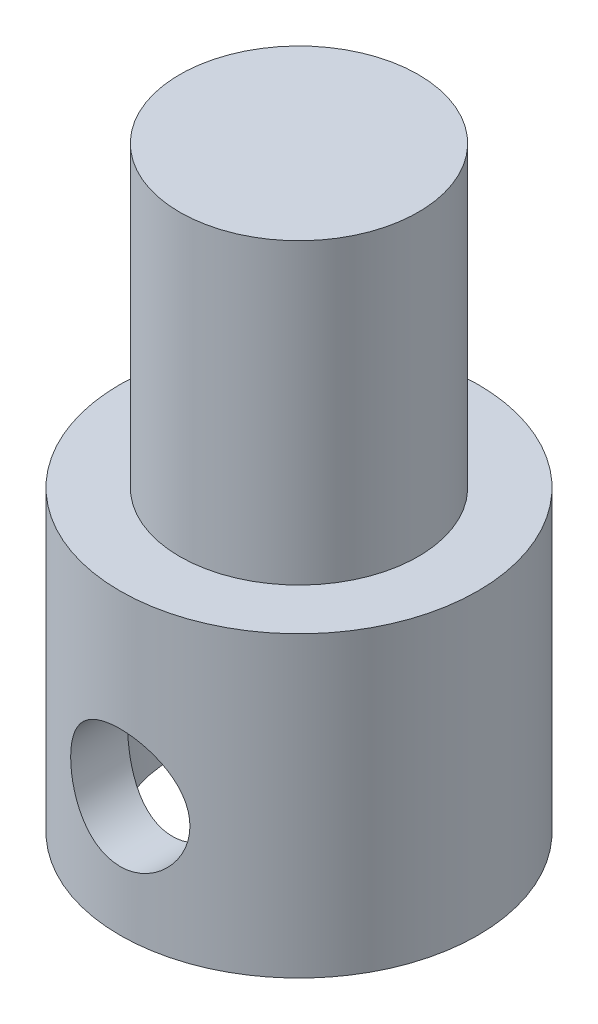
ISO-10303-21;
HEADER;
FILE_DESCRIPTION(('STEP AP214'),'2;1');
FILE_NAME('part.step','',(''),(''),'','','');
FILE_SCHEMA(('AUTOMOTIVE_DESIGN { 1 0 10303 214 1 1 1 1 }'));
ENDSEC;
DATA;
#1=APPLICATION_CONTEXT('core data for automotive mechanical design processes');
#2=APPLICATION_PROTOCOL_DEFINITION('international standard','automotive_design',2000,#1);
#3=PRODUCT_CONTEXT('',#1,'mechanical');
#4=PRODUCT('Part','Part','',(#3));
#5=PRODUCT_RELATED_PRODUCT_CATEGORY('part','',(#4));
#6=PRODUCT_DEFINITION_FORMATION('','',#4);
#7=PRODUCT_DEFINITION_CONTEXT('part definition',#1,'design');
#8=PRODUCT_DEFINITION('design','',#6,#7);
#9=PRODUCT_DEFINITION_SHAPE('','',#8);
#10=(LENGTH_UNIT() NAMED_UNIT(*) SI_UNIT(.MILLI.,.METRE.));
#11=(NAMED_UNIT(*) PLANE_ANGLE_UNIT() SI_UNIT($,.RADIAN.));
#12=(NAMED_UNIT(*) SI_UNIT($,.STERADIAN.) SOLID_ANGLE_UNIT());
#13=UNCERTAINTY_MEASURE_WITH_UNIT(LENGTH_MEASURE(1.E-05),#10,'distance_accuracy_value','');
#14=(GEOMETRIC_REPRESENTATION_CONTEXT(3) GLOBAL_UNCERTAINTY_ASSIGNED_CONTEXT((#13)) GLOBAL_UNIT_ASSIGNED_CONTEXT((#10,
#11,#12)) REPRESENTATION_CONTEXT('',''));
#15=CARTESIAN_POINT('',(0.,0.,0.));
#16=DIRECTION('',(0.,0.,1.));
#17=DIRECTION('',(1.,0.,0.));
#18=AXIS2_PLACEMENT_3D('',#15,#16,#17);
#19=CARTESIAN_POINT('',(0.,10.,0.));
#20=DIRECTION('',(0.,1.,0.));
#21=DIRECTION('',(0.,0.,1.));
#22=AXIS2_PLACEMENT_3D('',#19,#20,#21);
#23=PLANE('',#22);
#24=CARTESIAN_POINT('',(0.,10.,0.));
#25=DIRECTION('',(0.,1.,0.));
#26=DIRECTION('',(0.,0.,1.));
#27=AXIS2_PLACEMENT_3D('',#24,#25,#26);
#28=CIRCLE('',#27,6.);
#29=CARTESIAN_POINT('',(0.,10.,6.));
#30=VERTEX_POINT('',#29);
#31=EDGE_CURVE('E10',#30,#30,#28,.T.);
#32=ORIENTED_EDGE('',*,*,#31,.T.);
#33=EDGE_LOOP('',(#32));
#34=FACE_BOUND('',#33,.T.);
#35=CARTESIAN_POINT('',(0.,10.,0.));
#36=DIRECTION('',(0.,1.,0.));
#37=DIRECTION('',(0.,0.,1.));
#38=AXIS2_PLACEMENT_3D('',#35,#36,#37);
#39=CIRCLE('',#38,4.);
#40=CARTESIAN_POINT('',(0.,10.,4.));
#41=VERTEX_POINT('',#40);
#42=EDGE_CURVE('E52',#41,#41,#39,.T.);
#43=ORIENTED_EDGE('',*,*,#42,.F.);
#44=EDGE_LOOP('',(#43));
#45=FACE_BOUND('',#44,.T.);
#46=ADVANCED_FACE('F31',(#34,#45),#23,.T.);
#47=CARTESIAN_POINT('',(0.,10.,0.));
#48=DIRECTION('',(0.,-1.,0.));
#49=DIRECTION('',(0.,0.,-1.));
#50=AXIS2_PLACEMENT_3D('',#47,#48,#49);
#51=CYLINDRICAL_SURFACE('',#50,6.);
#52=CARTESIAN_POINT('',(0.,6.,-6.));
#53=CARTESIAN_POINT('',(-0.109126725773446,6.00000050746328,-6.00000030601888));
#54=CARTESIAN_POINT('',(-0.2182503890771,5.99103946774557,-5.99699539015089));
#55=CARTESIAN_POINT('',(-0.433283521745944,5.95554178236556,-5.98530420406561));
#56=CARTESIAN_POINT('',(-0.539192656237635,5.92900331210216,-5.97661734404305));
#57=CARTESIAN_POINT('',(-0.744665579003552,5.8593615132319,-5.95450615812885));
#58=CARTESIAN_POINT('',(-0.844239651772068,5.81628587508146,-5.94108975461706));
#59=CARTESIAN_POINT('',(-1.03474987361065,5.71491765432331,-5.91088891434683));
#60=CARTESIAN_POINT('',(-1.12568431391741,5.6566220699948,-5.89410381335556));
#61=CARTESIAN_POINT('',(-1.29948335004453,5.5243483902825,-5.8582818888601));
#62=CARTESIAN_POINT('',(-1.38200740059662,5.44993753147901,-5.83919112927569));
#63=CARTESIAN_POINT('',(-1.53366538540417,5.28846569058687,-5.80120629566243));
#64=CARTESIAN_POINT('',(-1.60279637097892,5.20140193014298,-5.78231226581098));
#65=CARTESIAN_POINT('',(-1.72764988445572,5.01402976960708,-5.74626664954547));
#66=CARTESIAN_POINT('',(-1.78292971644206,4.91341252053576,-5.72918078551376));
#67=CARTESIAN_POINT('',(-1.87563774775544,4.70364781108291,-5.69950610837202));
#68=CARTESIAN_POINT('',(-1.91307139477353,4.59450296567451,-5.68691592321491));
#69=CARTESIAN_POINT('',(-1.96774692301833,4.37465355700658,-5.66822606538754));
#70=CARTESIAN_POINT('',(-1.98562689654354,4.26412558302187,-5.66192191539222));
#71=CARTESIAN_POINT('',(-2.00268224666895,4.04147249168824,-5.65591313259015));
#72=CARTESIAN_POINT('',(-2.00186340320944,3.92934787858162,-5.6562064604546));
#73=CARTESIAN_POINT('',(-1.98203980740684,3.71212673911196,-5.6631803001636));
#74=CARTESIAN_POINT('',(-1.96386782633399,3.60694319416196,-5.66956831735066));
#75=CARTESIAN_POINT('',(-1.91121232569883,3.40121316078633,-5.68753315449102));
#76=CARTESIAN_POINT('',(-1.87672685318374,3.30066722912986,-5.69911059568215));
#77=CARTESIAN_POINT('',(-1.79187811612042,3.10517450081704,-5.72635822262497));
#78=CARTESIAN_POINT('',(-1.74126809741453,3.01034394906095,-5.74209131586234));
#79=CARTESIAN_POINT('',(-1.62577821260628,2.83025818344055,-5.77585117151453));
#80=CARTESIAN_POINT('',(-1.56089422472801,2.74500574613324,-5.79387859580927));
#81=CARTESIAN_POINT('',(-1.41469866536447,2.58181680367846,-5.83134658335482));
#82=CARTESIAN_POINT('',(-1.33270630015262,2.50449461098186,-5.85081178709685));
#83=CARTESIAN_POINT('',(-1.15667913994013,2.36453746667321,-5.88813876774073));
#84=CARTESIAN_POINT('',(-1.06264319132163,2.30190392367101,-5.90600039076135));
#85=CARTESIAN_POINT('',(-0.863895226092536,2.19260739952986,-5.93834215875587));
#86=CARTESIAN_POINT('',(-0.759086552832674,2.14610901731854,-5.95278700016078));
#87=CARTESIAN_POINT('',(-0.542538166729016,2.07159365208858,-5.97641134288869));
#88=CARTESIAN_POINT('',(-0.430800876309908,2.04357024915312,-5.98559267309758));
#89=CARTESIAN_POINT('',(-0.208767659058608,2.00788866795528,-5.99735254142881));
#90=CARTESIAN_POINT('',(-0.0986191997296925,1.9994003816545,-6.00020003667456));
#91=CARTESIAN_POINT('',(0.121550139920475,2.00066534719694,-5.99977805389655));
#92=CARTESIAN_POINT('',(0.231571038639301,2.01041551995975,-5.99650960838724));
#93=CARTESIAN_POINT('',(0.445039732608511,2.04722381547192,-5.98440049434208));
#94=CARTESIAN_POINT('',(0.548585613669686,2.07377241209899,-5.97572397422384));
#95=CARTESIAN_POINT('',(0.749711917159147,2.14278688893346,-5.9538369366014));
#96=CARTESIAN_POINT('',(0.847291577017212,2.18525479893557,-5.9406258409335));
#97=CARTESIAN_POINT('',(1.03657659278655,2.28614086368157,-5.91057862574579));
#98=CARTESIAN_POINT('',(1.12805991843429,2.34494918656634,-5.89365629511572));
#99=CARTESIAN_POINT('',(1.30012966027117,2.47638830002697,-5.85810507832525));
#100=CARTESIAN_POINT('',(1.38071273559115,2.54902331206353,-5.83947567187655));
#101=CARTESIAN_POINT('',(1.5325050156126,2.70995750201318,-5.80153695960889));
#102=CARTESIAN_POINT('',(1.60312193849154,2.79881845385372,-5.78223522174856));
#103=CARTESIAN_POINT('',(1.72851504464715,2.98754313562177,-5.74599946589417));
#104=CARTESIAN_POINT('',(1.78329109586203,3.08740695726815,-5.72906546764004));
#105=CARTESIAN_POINT('',(1.87519386083272,3.29534603057979,-5.69964783582767));
#106=CARTESIAN_POINT('',(1.91235626433004,3.40340415833753,-5.68715521585957));
#107=CARTESIAN_POINT('',(1.96778933351871,3.62475730008826,-5.66821664612899));
#108=CARTESIAN_POINT('',(1.98606850990788,3.7380499308087,-5.66176797247279));
#109=CARTESIAN_POINT('',(2.00255256495468,3.96039419208183,-5.65595717748354));
#110=CARTESIAN_POINT('',(2.0017405146168,4.06936468057365,-5.6562480051483));
#111=CARTESIAN_POINT('',(1.98248458689739,4.28553014984413,-5.66302539647735));
#112=CARTESIAN_POINT('',(1.96404175891717,4.39272523591018,-5.66951159138723));
#113=CARTESIAN_POINT('',(1.91074362625869,4.60027132600495,-5.68769048609783));
#114=CARTESIAN_POINT('',(1.87620669203103,4.70071365000899,-5.69928196044955));
#115=CARTESIAN_POINT('',(1.79195873151949,4.89445481387654,-5.72632797636937));
#116=CARTESIAN_POINT('',(1.74224433710761,4.98775206237601,-5.74178337526786));
#117=CARTESIAN_POINT('',(1.62652138516686,5.16896733984582,-5.77565658452092));
#118=CARTESIAN_POINT('',(1.55989648552916,5.25647300379677,-5.79417423284274));
#119=CARTESIAN_POINT('',(1.4132857662713,5.4193796267684,-5.83166712566506));
#120=CARTESIAN_POINT('',(1.33329616890296,5.49477715137615,-5.85064249824744));
#121=CARTESIAN_POINT('',(1.15848311384138,5.63428882457836,-5.88780061051088));
#122=CARTESIAN_POINT('',(1.06320302699946,5.697848695502,-5.90592363602513));
#123=CARTESIAN_POINT('',(0.86271471481325,5.80798085770129,-5.93851982345224));
#124=CARTESIAN_POINT('',(0.757509036264698,5.85455749184408,-5.95299391815859));
#125=CARTESIAN_POINT('',(0.544987294401952,5.92744326497734,-5.97611030137083));
#126=CARTESIAN_POINT('',(0.437975515352818,5.95456493252675,-5.98498424845045));
#127=CARTESIAN_POINT('',(0.220640832020494,5.99084056135425,-5.99692814128443));
#128=CARTESIAN_POINT('',(0.110318851137493,5.99999948699307,-5.9999996906381));
#129=CARTESIAN_POINT('',(0.,6.,-6.));
#130=B_SPLINE_CURVE_WITH_KNOTS('',3,(#52,#53,#54,#55,#56,#57,#58,#59,#60,#61,#62,#63,#64,#65,
#66,#67,#68,#69,#70,#71,#72,#73,#74,#75,#76,#77,#78,#79,#80,#81,#82,#83,#84,#85,#86,#87,#88,#89,
#90,#91,#92,#93,#94,#95,#96,#97,#98,#99,#100,#101,#102,#103,#104,#105,#106,#107,#108,#109,#110,
#111,#112,#113,#114,#115,#116,#117,#118,#119,#120,#121,#122,#123,#124,#125,#126,#127,#128,#129),
.UNSPECIFIED.,.T.,.F.,(4,2,2,2,2,2,2,2,2,2,2,2,2,2,2,2,2,2,2,2,2,2,2,2,2,2,2,2,2,2,2,2,2,2,2,2,
2,2,4),(0.,0.326974212052022,0.653982370535041,0.980445345740547,1.3069727555982,
1.64369368565512,1.9804886657506,2.32696769646941,2.67334089385667,3.0080385148368,
3.34263267974971,3.6619365310256,3.98127861710964,4.30576342310261,4.63034205116414,
4.97186611622734,5.31342291933236,5.65836811300715,6.00319337754416,6.33307166350339,
6.66289426328353,6.98316315956427,7.30347290568207,7.63220799687473,7.96104361643782,
8.30482045761503,8.64860016469993,8.9916802765354,9.3346056941168,9.65991332128516,
9.9852015870275,10.3043117416083,10.6234927635195,10.9566013338361,11.2898042224756,
11.635993216702,11.9820936230491,12.3127311674763,12.6432773207628),.UNSPECIFIED.);
#131=CARTESIAN_POINT('',(0.,6.,-6.));
#132=VERTEX_POINT('',#131);
#133=EDGE_CURVE('E77',#132,#132,#130,.T.);
#134=ORIENTED_EDGE('',*,*,#133,.T.);
#135=EDGE_LOOP('',(#134));
#136=FACE_BOUND('',#135,.T.);
#137=CARTESIAN_POINT('',(2.,4.,5.65685424949238));
#138=CARTESIAN_POINT('',(2.00000051589543,3.89106365032786,5.65685389060868));
#139=CARTESIAN_POINT('',(1.99106956737105,3.78213040035281,5.66003538581715));
#140=CARTESIAN_POINT('',(1.95570226337762,3.5674911580115,5.67235148162509));
#141=CARTESIAN_POINT('',(1.92926302433679,3.46178570025506,5.68148706284377));
#142=CARTESIAN_POINT('',(1.85991097136981,3.25674621400542,5.70456407377583));
#143=CARTESIAN_POINT('',(1.81703044280649,3.15740014111457,5.71849607942643));
#144=CARTESIAN_POINT('',(1.71612325688276,2.96727990290408,5.74958244020649));
#145=CARTESIAN_POINT('',(1.65809325772037,2.87650763489274,5.76673750607224));
#146=CARTESIAN_POINT('',(1.52610229288576,2.70256007532337,5.80308978814946));
#147=CARTESIAN_POINT('',(1.45164868275584,2.61976914265654,5.82233789689288));
#148=CARTESIAN_POINT('',(1.28997533442879,2.46758639755072,5.86027729602006));
#149=CARTESIAN_POINT('',(1.20275355010475,2.39819673683526,5.87896849657923));
#150=CARTESIAN_POINT('',(1.01520901593002,2.27304220534081,5.91427733843598));
#151=CARTESIAN_POINT('',(0.91460382244905,2.21768005876408,5.93082815403211));
#152=CARTESIAN_POINT('',(0.704862445974948,2.12481682974498,5.95939173541966));
#153=CARTESIAN_POINT('',(0.595728571374424,2.08731093364619,5.97140572406004));
#154=CARTESIAN_POINT('',(0.376057634866989,2.03252829073521,5.98918150863813));
#155=CARTESIAN_POINT('',(0.265701509705937,2.01459310748599,5.99514629555118));
#156=CARTESIAN_POINT('',(0.0433957496481795,1.99736741327868,6.00087216436495));
#157=CARTESIAN_POINT('',(-0.0685534670877923,1.99807209669518,6.00063484525791));
#158=CARTESIAN_POINT('',(-0.286207030387629,2.01768850913206,5.99412079237462));
#159=CARTESIAN_POINT('',(-0.391984097183313,2.03588505694898,5.98808129510235));
#160=CARTESIAN_POINT('',(-0.598886877644343,2.08878596196095,5.97093934679463));
#161=CARTESIAN_POINT('',(-0.700012275558431,2.12349143795965,5.95983655262363));
#162=CARTESIAN_POINT('',(-0.896304949683945,2.20884263461212,5.93351340586448));
#163=CARTESIAN_POINT('',(-0.99137644193769,2.25969187709302,5.91824085048031));
#164=CARTESIAN_POINT('',(-1.17184865105464,2.37571941089731,5.88516786077838));
#165=CARTESIAN_POINT('',(-1.25724666877068,2.44090168665526,5.86736672402933));
#166=CARTESIAN_POINT('',(-1.42020173310262,2.5873487869194,5.83012383699793));
#167=CARTESIAN_POINT('',(-1.49720031413054,2.66922631568296,5.81064430337755));
#168=CARTESIAN_POINT('',(-1.63655451919635,2.84489745145324,5.77294670497801));
#169=CARTESIAN_POINT('',(-1.69890788656309,2.93869289145609,5.75472883491231));
#170=CARTESIAN_POINT('',(-1.80797491007149,3.13730725120688,5.72141050242224));
#171=CARTESIAN_POINT('',(-1.85445292724268,3.24226426263555,5.70635818569496));
#172=CARTESIAN_POINT('',(-1.92888638653867,3.45914278842884,5.68163301648769));
#173=CARTESIAN_POINT('',(-1.95684959149499,3.57106136241249,5.67195790974185));
#174=CARTESIAN_POINT('',(-1.99232256419504,3.79327671082315,5.6595927263117));
#175=CARTESIAN_POINT('',(-2.00069819101527,3.90341884949731,5.65660720637512));
#176=CARTESIAN_POINT('',(-1.99921087781944,4.12355229822821,5.65713344118368));
#177=CARTESIAN_POINT('',(-1.98935125045353,4.23354363204798,5.66064401583629));
#178=CARTESIAN_POINT('',(-1.95245130310462,4.44631393142382,5.67347236180599));
#179=CARTESIAN_POINT('',(-1.92601278796137,4.54921086030168,5.6825865088168));
#180=CARTESIAN_POINT('',(-1.85742772512093,4.74908721247837,5.70537107342046));
#181=CARTESIAN_POINT('',(-1.81527839272684,4.84606558318156,5.71904229869679));
#182=CARTESIAN_POINT('',(-1.71494868147787,5.034760841694,5.74993755191574));
#183=CARTESIAN_POINT('',(-1.65630223671699,5.1262132852836,5.76726051331256));
#184=CARTESIAN_POINT('',(-1.52517126111512,5.29829210476744,5.8033153746193));
#185=CARTESIAN_POINT('',(-1.45268265099756,5.37891527732244,5.82204768887589));
#186=CARTESIAN_POINT('',(-1.29178341180065,5.53105596818128,5.85990077275698));
#187=CARTESIAN_POINT('',(-1.20277454109331,5.6019487800377,5.87899687155793));
#188=CARTESIAN_POINT('',(-1.01365458280051,5.72783228469609,5.91453703226217));
#189=CARTESIAN_POINT('',(-0.913543889729105,5.78282354232485,5.93098118835389));
#190=CARTESIAN_POINT('',(-0.705559724864591,5.87484020972343,5.95928811621206));
#191=CARTESIAN_POINT('',(-0.597742246642394,5.91198255429613,5.97118060009062));
#192=CARTESIAN_POINT('',(-0.376916931692033,5.96745548412021,5.98917221675549));
#193=CARTESIAN_POINT('',(-0.263910983907779,5.98579285976101,5.99527344068037));
#194=CARTESIAN_POINT('',(-0.0416306717200821,6.00252415521128,6.00083726472513));
#195=CARTESIAN_POINT('',(0.0675694478400367,6.00181490786475,6.00059840178878));
#196=CARTESIAN_POINT('',(0.284222290000347,5.98268538370718,5.99424393038796));
#197=CARTESIAN_POINT('',(0.391675153638113,5.96426654369446,5.98812879867152));
#198=CARTESIAN_POINT('',(0.600084238864117,5.91083553084808,5.97081829908825));
#199=CARTESIAN_POINT('',(0.701116541825578,5.87609156929413,5.95970516722297));
#200=CARTESIAN_POINT('',(0.895956701879591,5.79124493780569,5.9335432140899));
#201=CARTESIAN_POINT('',(0.989763248284864,5.74113948960597,5.91849368096033));
#202=CARTESIAN_POINT('',(1.17126803261757,5.62486097579599,5.88531737655762));
#203=CARTESIAN_POINT('',(1.25861250311521,5.55816262923672,5.86709744983853));
#204=CARTESIAN_POINT('',(1.42116205254485,5.41148521768761,5.82985977583759));
#205=CARTESIAN_POINT('',(1.49636324324918,5.33150191547455,5.81084177546194));
#206=CARTESIAN_POINT('',(1.63548361766623,5.1567812888261,5.77326559651196));
#207=CARTESIAN_POINT('',(1.6988459319958,5.06158897804672,5.75475455977261));
#208=CARTESIAN_POINT('',(1.80862868660223,4.86133114619444,5.7212038664603));
#209=CARTESIAN_POINT('',(1.85505355363895,4.75626821394067,5.70616330322498));
#210=CARTESIAN_POINT('',(1.92768765640833,4.54407635196874,5.68202668413029));
#211=CARTESIAN_POINT('',(1.95471581829904,4.43725547294927,5.67269265714364));
#212=CARTESIAN_POINT('',(1.99086864029853,4.2202878990666,5.66010767079036));
#213=CARTESIAN_POINT('',(1.99999947839318,4.11014236517858,5.65685461234922));
#214=CARTESIAN_POINT('',(2.,4.,5.65685424949238));
#215=B_SPLINE_CURVE_WITH_KNOTS('',3,(#137,#138,#139,#140,#141,#142,#143,#144,#145,#146,#147,
#148,#149,#150,#151,#152,#153,#154,#155,#156,#157,#158,#159,#160,#161,#162,#163,#164,#165,#166,
#167,#168,#169,#170,#171,#172,#173,#174,#175,#176,#177,#178,#179,#180,#181,#182,#183,#184,#185,
#186,#187,#188,#189,#190,#191,#192,#193,#194,#195,#196,#197,#198,#199,#200,#201,#202,#203,#204,
#205,#206,#207,#208,#209,#210,#211,#212,#213,#214),.UNSPECIFIED.,.T.,.F.,(4,2,2,2,2,2,2,2,2,2,2,
2,2,2,2,2,2,2,2,2,2,2,2,2,2,2,2,2,2,2,2,2,2,2,2,2,2,2,4),(0.,0.326401169598712,
0.652856110030327,0.978673255001655,1.30456233237088,1.64202674855136,1.97954530343976,
2.32587012287314,2.67210152773578,3.00628637529868,3.34038506604654,3.66138009651138,
3.98239688378473,4.3076330972067,4.63295983748044,4.97360348727835,5.31429959224212,
5.65985279686111,6.00526102713231,6.33508582728879,6.66485071674467,6.98328791537552,
7.30178158293891,7.63037715471429,7.95906971324254,8.30357616342185,8.64807037515064,
8.99027582381703,9.33235766008313,9.65836169355271,9.98433928019562,10.3051391208086,
10.6259970152648,10.9587103904127,11.2915300886526,11.6373780547229,11.9831355653373,
12.3132642432538,12.6432789438093),.UNSPECIFIED.);
#216=CARTESIAN_POINT('',(2.,4.,5.65685424949238));
#217=VERTEX_POINT('',#216);
#218=EDGE_CURVE('E73',#217,#217,#215,.T.);
#219=ORIENTED_EDGE('',*,*,#218,.T.);
#220=EDGE_LOOP('',(#219));
#221=FACE_BOUND('',#220,.T.);
#222=ORIENTED_EDGE('',*,*,#31,.F.);
#223=EDGE_LOOP('',(#222));
#224=FACE_BOUND('',#223,.T.);
#225=CARTESIAN_POINT('',(0.,0.,0.));
#226=DIRECTION('',(0.,1.,0.));
#227=DIRECTION('',(0.,0.,1.));
#228=AXIS2_PLACEMENT_3D('',#225,#226,#227);
#229=CIRCLE('',#228,6.);
#230=CARTESIAN_POINT('',(0.,0.,6.));
#231=VERTEX_POINT('',#230);
#232=EDGE_CURVE('E44',#231,#231,#229,.T.);
#233=ORIENTED_EDGE('',*,*,#232,.T.);
#234=EDGE_LOOP('',(#233));
#235=FACE_BOUND('',#234,.T.);
#236=ADVANCED_FACE('F33',(#136,#221,#224,#235),#51,.T.);
#237=CARTESIAN_POINT('',(0.,0.,0.));
#238=DIRECTION('',(0.,1.,0.));
#239=DIRECTION('',(0.,0.,1.));
#240=AXIS2_PLACEMENT_3D('',#237,#238,#239);
#241=PLANE('',#240);
#242=CARTESIAN_POINT('',(0.,0.,0.));
#243=DIRECTION('',(0.,-1.,0.));
#244=DIRECTION('',(0.,0.,-1.));
#245=AXIS2_PLACEMENT_3D('',#242,#243,#244);
#246=CIRCLE('',#245,4.25);
#247=CARTESIAN_POINT('',(0.,0.,-4.25));
#248=VERTEX_POINT('',#247);
#249=EDGE_CURVE('E82',#248,#248,#246,.T.);
#250=ORIENTED_EDGE('',*,*,#249,.F.);
#251=EDGE_LOOP('',(#250));
#252=FACE_BOUND('',#251,.T.);
#253=ORIENTED_EDGE('',*,*,#232,.F.);
#254=EDGE_LOOP('',(#253));
#255=FACE_BOUND('',#254,.T.);
#256=ADVANCED_FACE('F100',(#252,#255),#241,.F.);
#257=CARTESIAN_POINT('',(0.,20.,0.));
#258=DIRECTION('',(0.,-1.,0.));
#259=DIRECTION('',(0.,0.,-1.));
#260=AXIS2_PLACEMENT_3D('',#257,#258,#259);
#261=CYLINDRICAL_SURFACE('',#260,4.);
#262=CARTESIAN_POINT('',(0.,20.,0.));
#263=DIRECTION('',(0.,1.,0.));
#264=DIRECTION('',(0.,0.,1.));
#265=AXIS2_PLACEMENT_3D('',#262,#263,#264);
#266=CIRCLE('',#265,4.);
#267=CARTESIAN_POINT('',(0.,20.,4.));
#268=VERTEX_POINT('',#267);
#269=EDGE_CURVE('E49',#268,#268,#266,.T.);
#270=ORIENTED_EDGE('',*,*,#269,.F.);
#271=EDGE_LOOP('',(#270));
#272=FACE_BOUND('',#271,.T.);
#273=ORIENTED_EDGE('',*,*,#42,.T.);
#274=EDGE_LOOP('',(#273));
#275=FACE_BOUND('',#274,.T.);
#276=ADVANCED_FACE('F93',(#272,#275),#261,.T.);
#277=CARTESIAN_POINT('',(0.,20.,0.));
#278=DIRECTION('',(0.,1.,0.));
#279=DIRECTION('',(0.,0.,1.));
#280=AXIS2_PLACEMENT_3D('',#277,#278,#279);
#281=PLANE('',#280);
#282=ORIENTED_EDGE('',*,*,#269,.T.);
#283=EDGE_LOOP('',(#282));
#284=FACE_BOUND('',#283,.T.);
#285=ADVANCED_FACE('F108',(#284),#281,.T.);
#286=CARTESIAN_POINT('',(0.,8.,0.));
#287=DIRECTION('',(0.,-1.,0.));
#288=DIRECTION('',(0.,0.,-1.));
#289=AXIS2_PLACEMENT_3D('',#286,#287,#288);
#290=CYLINDRICAL_SURFACE('',#289,4.25);
#291=CARTESIAN_POINT('',(0.,6.,-4.25));
#292=CARTESIAN_POINT('',(0.105871059149561,5.99999409063471,-4.24999501672174));
#293=CARTESIAN_POINT('',(0.211889826042652,5.99154396136875,-4.24600055225517));
#294=CARTESIAN_POINT('',(0.420839602880815,5.958095722954,-4.23041695023392));
#295=CARTESIAN_POINT('',(0.52376336869274,5.93306153760719,-4.21881125611067));
#296=CARTESIAN_POINT('',(0.723173878337782,5.867615726974,-4.18922939752824));
#297=CARTESIAN_POINT('',(0.8196830464565,5.8272613857168,-4.17127698127016));
#298=CARTESIAN_POINT('',(1.0044398223861,5.73259475688806,-4.13068518172628));
#299=CARTESIAN_POINT('',(1.09268872481146,5.67828466158722,-4.10804653469598));
#300=CARTESIAN_POINT('',(1.26392455033518,5.55380544594809,-4.05873967893696));
#301=CARTESIAN_POINT('',(1.3463491186544,5.48292442780353,-4.03191771501793));
#302=CARTESIAN_POINT('',(1.4986476575487,5.32883540492639,-3.97782593635649));
#303=CARTESIAN_POINT('',(1.56851321989917,5.24561920933215,-3.95055583482041));
#304=CARTESIAN_POINT('',(1.69835351712052,5.06254742805899,-3.89658395161941));
#305=CARTESIAN_POINT('',(1.75735961813898,4.9619527660004,-3.8700409808222));
#306=CARTESIAN_POINT('',(1.85736877238298,4.75086324586442,-3.82305583598051));
#307=CARTESIAN_POINT('',(1.89838348819139,4.64037485731991,-3.80260971252858));
#308=CARTESIAN_POINT('',(1.95877454614056,4.41904809894785,-3.77184300792218));
#309=CARTESIAN_POINT('',(1.97924028051801,4.30858051621672,-3.7610166353829));
#310=CARTESIAN_POINT('',(2.00132060875908,4.08529134488966,-3.74931857537696));
#311=CARTESIAN_POINT('',(2.00295030987974,3.97247171550256,-3.74843891026276));
#312=CARTESIAN_POINT('',(1.98811796191759,3.76012810142369,-3.75631826072012));
#313=CARTESIAN_POINT('',(1.97350028282984,3.66043056691468,-3.76409477837728));
#314=CARTESIAN_POINT('',(1.9297458531108,3.46511554383583,-3.78671111411083));
#315=CARTESIAN_POINT('',(1.90060527906891,3.36949913689591,-3.80155279217032));
#316=CARTESIAN_POINT('',(1.82806435546186,3.18238886292122,-3.83696951615222));
#317=CARTESIAN_POINT('',(1.7843497166112,3.09104153833629,-3.85766925447546));
#318=CARTESIAN_POINT('',(1.68413318492711,2.9165663390631,-3.90246130874407));
#319=CARTESIAN_POINT('',(1.62762567567576,2.83344209763413,-3.92655511301628));
#320=CARTESIAN_POINT('',(1.49612006954125,2.66809148289758,-3.97864984776727));
#321=CARTESIAN_POINT('',(1.41976798693356,2.58698169255986,-4.00678814741034));
#322=CARTESIAN_POINT('',(1.25436042487161,2.43828516986544,-4.06160929195891));
#323=CARTESIAN_POINT('',(1.16530016346911,2.37070355111771,-4.08829158373605));
#324=CARTESIAN_POINT('',(0.972806177325518,2.24868741671682,-4.13840356403142));
#325=CARTESIAN_POINT('',(0.868964274970258,2.19482787272799,-4.1616775271474));
#326=CARTESIAN_POINT('',(0.652317629183457,2.10575306451743,-4.20107928024973));
#327=CARTESIAN_POINT('',(0.539519283627298,2.07052462687504,-4.21721211816308));
#328=CARTESIAN_POINT('',(0.31737875996087,2.02232729545314,-4.23948952533914));
#329=CARTESIAN_POINT('',(0.20842724292498,2.00786792790555,-4.24630101292144));
#330=CARTESIAN_POINT('',(-0.0105532669860137,1.99702933256103,-4.25139549281652));
#331=CARTESIAN_POINT('',(-0.120581814399558,2.00064292097098,-4.24968187376304));
#332=CARTESIAN_POINT('',(-0.330801977520075,2.02490059736014,-4.23832746137203));
#333=CARTESIAN_POINT('',(-0.431159605950264,2.04439048943359,-4.22922405189799));
#334=CARTESIAN_POINT('',(-0.627012300933761,2.09811392190996,-4.20465241254947));
#335=CARTESIAN_POINT('',(-0.722506800789447,2.13234917620543,-4.18918344279834));
#336=CARTESIAN_POINT('',(-0.909254403402077,2.21561507790237,-4.15272065515054));
#337=CARTESIAN_POINT('',(-1.00028949047903,2.26506490931298,-4.13157280164464));
#338=CARTESIAN_POINT('',(-1.1730906488888,2.37689715475718,-4.08587319946851));
#339=CARTESIAN_POINT('',(-1.25485262612434,2.43928524694245,-4.06131995786446));
#340=CARTESIAN_POINT('',(-1.41448599818457,2.58166889026106,-4.00866657010795));
#341=CARTESIAN_POINT('',(-1.49136222549231,2.66273777612949,-3.98044529244252));
#342=CARTESIAN_POINT('',(-1.63080783287537,2.83685143101821,-3.9253787732795));
#343=CARTESIAN_POINT('',(-1.69337004577724,2.92990216318999,-3.89853422632136));
#344=CARTESIAN_POINT('',(-1.80434150010071,3.12947217254754,-3.8484664097083));
#345=CARTESIAN_POINT('',(-1.85219445431859,3.23634288337031,-3.82539811391115));
#346=CARTESIAN_POINT('',(-1.92873631372931,3.45806812958011,-3.78739128651415));
#347=CARTESIAN_POINT('',(-1.95744685216814,3.57291348995876,-3.77244358121594));
#348=CARTESIAN_POINT('',(-1.99248621232382,3.79610001370628,-3.7540451191717));
#349=CARTESIAN_POINT('',(-2.0006137895414,3.90408221651796,-3.74967203907467));
#350=CARTESIAN_POINT('',(-1.99931434789286,4.11989488029124,-3.75036628700348));
#351=CARTESIAN_POINT('',(-1.98989251151428,4.22772537664253,-3.75543082802164));
#352=CARTESIAN_POINT('',(-1.95539012584309,4.43167404099269,-3.7734967694282));
#353=CARTESIAN_POINT('',(-1.931542562584,4.5280626160761,-3.78587157240528));
#354=CARTESIAN_POINT('',(-1.87026678165299,4.71541867197713,-3.81651263962931));
#355=CARTESIAN_POINT('',(-1.83283449175123,4.80638451771888,-3.83478067027888));
#356=CARTESIAN_POINT('',(-1.7426278073447,4.9869676546753,-3.87664451375815));
#357=CARTESIAN_POINT('',(-1.68899863532572,5.07609291219961,-3.90051385578242));
#358=CARTESIAN_POINT('',(-1.56895109112261,5.24463188597259,-3.95033091262379));
#359=CARTESIAN_POINT('',(-1.50252664918307,5.32404096375815,-3.97627961040974));
#360=CARTESIAN_POINT('',(-1.35073812492974,5.47934836691562,-4.03052625737342));
#361=CARTESIAN_POINT('',(-1.26412938375078,5.55404800460965,-4.05879169857362));
#362=CARTESIAN_POINT('',(-1.07869551476585,5.68804568450385,-4.11195927658417));
#363=CARTESIAN_POINT('',(-0.979864545572223,5.74733631994526,-4.13685979320114));
#364=CARTESIAN_POINT('',(-0.77278854278162,5.84824532462197,-4.18048397470693));
#365=CARTESIAN_POINT('',(-0.664583824368734,5.88993524788358,-4.19923257892042));
#366=CARTESIAN_POINT('',(-0.441729685596168,5.95403025694957,-4.22846407633018));
#367=CARTESIAN_POINT('',(-0.32710043774906,5.97649245852973,-4.23897144221042));
#368=CARTESIAN_POINT('',(-0.176275280643624,5.99253131316743,-4.24649006313174));
#369=CARTESIAN_POINT('',(-0.141096629845225,5.99532893212952,-4.2478035716459));
#370=CARTESIAN_POINT('',(-0.0706174666611003,5.99906428102846,-4.24955938054871));
#371=CARTESIAN_POINT('',(-0.0353169516908068,6.00000197127307,-4.25000166234474));
#372=CARTESIAN_POINT('',(0.,6.,-4.25));
#373=B_SPLINE_CURVE_WITH_KNOTS('',3,(#291,#292,#293,#294,#295,#296,#297,#298,#299,#300,#301,
#302,#303,#304,#305,#306,#307,#308,#309,#310,#311,#312,#313,#314,#315,#316,#317,#318,#319,#320,
#321,#322,#323,#324,#325,#326,#327,#328,#329,#330,#331,#332,#333,#334,#335,#336,#337,#338,#339,
#340,#341,#342,#343,#344,#345,#346,#347,#348,#349,#350,#351,#352,#353,#354,#355,#356,#357,#358,
#359,#360,#361,#362,#363,#364,#365,#366,#367,#368,#369,#370,#371,#372),.UNSPECIFIED.,.T.,.F.,(4,
2,2,2,2,2,2,2,2,2,2,2,2,2,2,2,2,2,2,2,2,2,2,2,2,2,2,2,2,2,2,2,2,2,2,2,2,2,2,2,4),(0.,
0.317468963430246,0.635630812150111,0.952614546487504,1.26954851713712,1.60404044269807,
1.9387554824617,2.29576275046306,2.65253825187577,2.98920306211506,3.32559783486664,
3.62737787265625,3.92923740141478,4.23808012859152,4.54705870997163,4.89021790169536,
5.23350656265288,5.58942136036763,5.94508416526045,6.27366971121757,6.60212465856392,
6.90863067904059,7.21517233514339,7.53105800854259,7.84708260764276,8.19125513361926,
8.53559961499128,8.89170349343039,9.24740424616268,9.57074097297067,9.89398223089674,
10.1928746721075,10.4918567850119,10.8107230116018,11.1297408745104,11.48153125132,
11.8334904143513,12.1840046113164,12.5334739595793,12.6393744471102,12.7452771946114),.UNSPECIFIED.);
#374=CARTESIAN_POINT('',(0.,6.,-4.25));
#375=VERTEX_POINT('',#374);
#376=EDGE_CURVE('E36',#375,#375,#373,.T.);
#377=ORIENTED_EDGE('',*,*,#376,.T.);
#378=EDGE_LOOP('',(#377));
#379=FACE_BOUND('',#378,.T.);
#380=CARTESIAN_POINT('',(2.,4.,3.75));
#381=CARTESIAN_POINT('',(1.99999278334831,4.10513510638214,3.75000826796811));
#382=CARTESIAN_POINT('',(1.99165534548257,4.21042730687002,3.75448741611178));
#383=CARTESIAN_POINT('',(1.9586947567193,4.41785151448915,3.77178217595778));
#384=CARTESIAN_POINT('',(1.93403347520456,4.51997553500595,3.78461730511013));
#385=CARTESIAN_POINT('',(1.86967542118155,4.71768309554078,3.81681669010791));
#386=CARTESIAN_POINT('',(1.830051499051,4.81329571763341,3.83614926171453));
#387=CARTESIAN_POINT('',(1.7371133035507,4.9964930187898,3.8791171172447));
#388=CARTESIAN_POINT('',(1.68379970257275,5.08407809185364,3.90275218982703));
#389=CARTESIAN_POINT('',(1.56044698465515,5.25577617911027,3.95376638499197));
#390=CARTESIAN_POINT('',(1.48947442523931,5.33917516974004,3.98129275682108));
#391=CARTESIAN_POINT('',(1.33476674141144,5.4934317280766,4.03579286280295));
#392=CARTESIAN_POINT('',(1.25102587007802,5.5642836172328,4.06276634186981));
#393=CARTESIAN_POINT('',(1.06720742669445,5.69544548377458,4.11499751826751));
#394=CARTESIAN_POINT('',(0.966463718686679,5.75490480112909,4.14006473333047));
#395=CARTESIAN_POINT('',(0.755005012555766,5.85571085701171,4.18378926835612));
#396=CARTESIAN_POINT('',(0.644295647361228,5.89706775109799,4.20245018101864));
#397=CARTESIAN_POINT('',(0.423589142627606,5.9577577751267,4.23020518255978));
#398=CARTESIAN_POINT('',(0.314003244761924,5.97833519198889,4.23983689955265));
#399=CARTESIAN_POINT('',(0.0925416224293564,6.00095133800805,4.25043525721606));
#400=CARTESIAN_POINT('',(-0.0193328624347098,6.00299985003698,4.25140647044658));
#401=CARTESIAN_POINT('',(-0.232957740722034,5.98904488641307,4.24485266705178));
#402=CARTESIAN_POINT('',(-0.334822623791655,5.97442364877398,4.23797816327235));
#403=CARTESIAN_POINT('',(-0.534453784798003,5.92997880562871,4.21745550548781));
#404=CARTESIAN_POINT('',(-0.632219757586313,5.90015407044668,4.20380684814013));
#405=CARTESIAN_POINT('',(-0.822665598035227,5.82587747095041,4.17075647852706));
#406=CARTESIAN_POINT('',(-0.915248575743636,5.78121531197563,4.15127247601058));
#407=CARTESIAN_POINT('',(-1.09184352283673,5.67878198789228,4.10836318891236));
#408=CARTESIAN_POINT('',(-1.17585233535157,5.62100601954996,4.08493646103174));
#409=CARTESIAN_POINT('',(-1.3406281412046,5.48823863898364,4.03401523997975));
#410=CARTESIAN_POINT('',(-1.42049184689529,5.41219271177948,4.00634417696808));
#411=CARTESIAN_POINT('',(-1.56678712698686,5.24791336564139,3.95142965483085));
#412=CARTESIAN_POINT('',(-1.6332103925353,5.15967246417627,3.92418646975783));
#413=CARTESIAN_POINT('',(-1.7540295774939,4.96791692469586,3.87174945488623));
#414=CARTESIAN_POINT('',(-1.80763495532406,4.86385138535985,3.84673212699416));
#415=CARTESIAN_POINT('',(-1.89617795542451,4.6467014855463,3.80387372392299));
#416=CARTESIAN_POINT('',(-1.93113301673437,4.53362566429973,3.78602594870347));
#417=CARTESIAN_POINT('',(-1.97875198730774,4.3106961373909,3.76134460330747));
#418=CARTESIAN_POINT('',(-1.99289764315747,4.20124210992727,3.75378216701704));
#419=CARTESIAN_POINT('',(-2.00293559518052,3.98128665099591,3.7484386188378));
#420=CARTESIAN_POINT('',(-1.99883779152855,3.87078582007873,3.75065220179326));
#421=CARTESIAN_POINT('',(-1.97386396774598,3.66259051014701,3.76384360402555));
#422=CARTESIAN_POINT('',(-1.95455509541394,3.56464839119999,3.77400220115419));
#423=CARTESIAN_POINT('',(-1.90193965757173,3.3735379607881,3.80078810785453));
#424=CARTESIAN_POINT('',(-1.86862912910832,3.28037100924332,3.81741724871497));
#425=CARTESIAN_POINT('',(-1.78730013829356,3.09660644214982,3.85618583973217));
#426=CARTESIAN_POINT('',(-1.7386742081627,3.00632548708452,3.87854405125037));
#427=CARTESIAN_POINT('',(-1.62864818014454,2.83470718032383,3.92601486842523));
#428=CARTESIAN_POINT('',(-1.56724172949261,2.75337430726735,3.95112884093125));
#429=CARTESIAN_POINT('',(-1.42555297710963,2.59270380725006,4.00457596290923));
#430=CARTESIAN_POINT('',(-1.34394295832099,2.51454932906137,4.03296169775042));
#431=CARTESIAN_POINT('',(-1.16822321572152,2.37273142341179,4.08732284866462));
#432=CARTESIAN_POINT('',(-1.07411070781091,2.3090712321855,4.11329772568422));
#433=CARTESIAN_POINT('',(-0.873847730637515,2.19729729764738,4.1604837597342));
#434=CARTESIAN_POINT('',(-0.767529784141006,2.14944657699015,4.18161268955573));
#435=CARTESIAN_POINT('',(-0.54707864430347,2.07274920372651,4.21611347538402));
#436=CARTESIAN_POINT('',(-0.432951590741837,2.0438878063873,4.22949134892534));
#437=CARTESIAN_POINT('',(-0.210536703782472,2.00819878207909,4.24612174611846));
#438=CARTESIAN_POINT('',(-0.102570398118322,1.99971532024239,4.25013436745783));
#439=CARTESIAN_POINT('',(0.113289661299027,2.00029904199656,4.24985887396117));
#440=CARTESIAN_POINT('',(0.221183426837405,2.00936140199011,4.24557304048902));
#441=CARTESIAN_POINT('',(0.427754839680973,2.04362563003849,4.22962074592407));
#442=CARTESIAN_POINT('',(0.526615823187468,2.06793154475084,4.21836441710533));
#443=CARTESIAN_POINT('',(0.718742401161493,2.13087352537317,4.18991025109669));
#444=CARTESIAN_POINT('',(0.812007096255171,2.16951188750859,4.17271146188552));
#445=CARTESIAN_POINT('',(0.994986067640842,2.26190344981301,4.1329970139072));
#446=CARTESIAN_POINT('',(1.08434967071781,2.31626056209605,4.11027628014111));
#447=CARTESIAN_POINT('',(1.25307691467297,2.43775161154145,4.06202064120849));
#448=CARTESIAN_POINT('',(1.33243600049027,2.5048913339601,4.03648446401712));
#449=CARTESIAN_POINT('',(1.48629743882136,2.65700626171575,3.98254227734094));
#450=CARTESIAN_POINT('',(1.5597427906502,2.7430358134209,3.9540827855971));
#451=CARTESIAN_POINT('',(1.69145664018933,2.92679202849284,3.89955982632019));
#452=CARTESIAN_POINT('',(1.74971411835707,3.0245271101748,3.87349810731044));
#453=CARTESIAN_POINT('',(1.84998465272071,3.23129101432341,3.82664282343477));
#454=CARTESIAN_POINT('',(1.89173472202985,3.34047012492208,3.80593623458336));
#455=CARTESIAN_POINT('',(1.93969419917216,3.50907349256242,3.78158635213793));
#456=CARTESIAN_POINT('',(1.95323067130279,3.56602562537661,3.77459142814059));
#457=CARTESIAN_POINT('',(1.97528331651135,3.68112786937503,3.76309905665188));
#458=CARTESIAN_POINT('',(1.98380314034534,3.73927707743976,3.75859979313677));
#459=CARTESIAN_POINT('',(1.99315910354233,3.83130962814057,3.75364230035762));
#460=CARTESIAN_POINT('',(1.99572230857722,3.86497994044978,3.75227911858267));
#461=CARTESIAN_POINT('',(1.9991439586842,3.93242808802404,3.75045661730994));
#462=CARTESIAN_POINT('',(2.00000231968228,3.96620592850954,3.74999734238814));
#463=CARTESIAN_POINT('',(2.,4.,3.75));
#464=B_SPLINE_CURVE_WITH_KNOTS('',3,(#380,#381,#382,#383,#384,#385,#386,#387,#388,#389,#390,
#391,#392,#393,#394,#395,#396,#397,#398,#399,#400,#401,#402,#403,#404,#405,#406,#407,#408,#409,
#410,#411,#412,#413,#414,#415,#416,#417,#418,#419,#420,#421,#422,#423,#424,#425,#426,#427,#428,
#429,#430,#431,#432,#433,#434,#435,#436,#437,#438,#439,#440,#441,#442,#443,#444,#445,#446,#447,
#448,#449,#450,#451,#452,#453,#454,#455,#456,#457,#458,#459,#460,#461,#462,#463),.UNSPECIFIED.,
.T.,.F.,(4,2,2,2,2,2,2,2,2,2,2,2,2,2,2,2,2,2,2,2,2,2,2,2,2,2,2,2,2,2,2,2,2,2,2,2,2,2,2,2,2,4),
(0.,0.315269532227727,0.631278108915347,0.945767530612493,1.26024150858191,1.59755236089319,
1.93501548491413,2.29206735755065,2.64891866460436,2.98284261865034,3.31659025757551,
3.62455689648693,3.93254642178981,4.24510194492122,4.55777213395658,4.89738779630131,
5.23721277119902,5.59444791639952,5.9513484396961,6.28134455917521,6.61116162155771,
6.91084495979815,7.21061317596953,7.52420647490136,7.83795602433331,8.18589395188133,
8.5339094897974,8.88745332877816,9.24072232485334,9.56413887866948,9.88746653327509,
10.1933723847735,10.4993272671441,10.8191023907284,11.1390225862344,11.4873507068093,
11.835930857445,12.1898599395636,12.3664988027649,12.5430089615176,12.6443425322433,
12.7456811000871),.UNSPECIFIED.);
#465=CARTESIAN_POINT('',(2.,4.,3.75));
#466=VERTEX_POINT('',#465);
#467=EDGE_CURVE('E54',#466,#466,#464,.T.);
#468=ORIENTED_EDGE('',*,*,#467,.T.);
#469=EDGE_LOOP('',(#468));
#470=FACE_BOUND('',#469,.T.);
#471=CARTESIAN_POINT('',(0.,8.,0.));
#472=DIRECTION('',(0.,-1.,0.));
#473=DIRECTION('',(0.,0.,-1.));
#474=AXIS2_PLACEMENT_3D('',#471,#472,#473);
#475=CIRCLE('',#474,4.25);
#476=CARTESIAN_POINT('',(0.,8.,-4.25));
#477=VERTEX_POINT('',#476);
#478=EDGE_CURVE('E83',#477,#477,#475,.T.);
#479=ORIENTED_EDGE('',*,*,#478,.F.);
#480=EDGE_LOOP('',(#479));
#481=FACE_BOUND('',#480,.T.);
#482=ORIENTED_EDGE('',*,*,#249,.T.);
#483=EDGE_LOOP('',(#482));
#484=FACE_BOUND('',#483,.T.);
#485=ADVANCED_FACE('F58',(#379,#470,#481,#484),#290,.F.);
#486=CARTESIAN_POINT('',(0.,8.,0.));
#487=DIRECTION('',(0.,-1.,0.));
#488=DIRECTION('',(0.,0.,-1.));
#489=AXIS2_PLACEMENT_3D('',#486,#487,#488);
#490=PLANE('',#489);
#491=ORIENTED_EDGE('',*,*,#478,.T.);
#492=EDGE_LOOP('',(#491));
#493=FACE_BOUND('',#492,.T.);
#494=ADVANCED_FACE('F67',(#493),#490,.T.);
#495=CARTESIAN_POINT('',(0.,4.,-6.));
#496=DIRECTION('',(0.,0.,1.));
#497=DIRECTION('',(1.,0.,0.));
#498=AXIS2_PLACEMENT_3D('',#495,#496,#497);
#499=CYLINDRICAL_SURFACE('',#498,2.);
#500=ORIENTED_EDGE('',*,*,#467,.F.);
#501=EDGE_LOOP('',(#500));
#502=FACE_BOUND('',#501,.T.);
#503=ORIENTED_EDGE('',*,*,#218,.F.);
#504=EDGE_LOOP('',(#503));
#505=FACE_BOUND('',#504,.T.);
#506=ADVANCED_FACE('F65',(#502,#505),#499,.F.);
#507=ORIENTED_EDGE('',*,*,#376,.F.);
#508=EDGE_LOOP('',(#507));
#509=FACE_BOUND('',#508,.T.);
#510=ORIENTED_EDGE('',*,*,#133,.F.);
#511=EDGE_LOOP('',(#510));
#512=FACE_BOUND('',#511,.T.);
#513=ADVANCED_FACE('F62',(#509,#512),#499,.F.);
#514=CLOSED_SHELL('',(#46,#236,#256,#276,#285,#485,#494,#506,#513));
#515=MANIFOLD_SOLID_BREP('B2',#514);
#516=ADVANCED_BREP_SHAPE_REPRESENTATION('',(#18,#515),#14);
#517=SHAPE_DEFINITION_REPRESENTATION(#9,#516);
ENDSEC;
END-ISO-10303-21;
